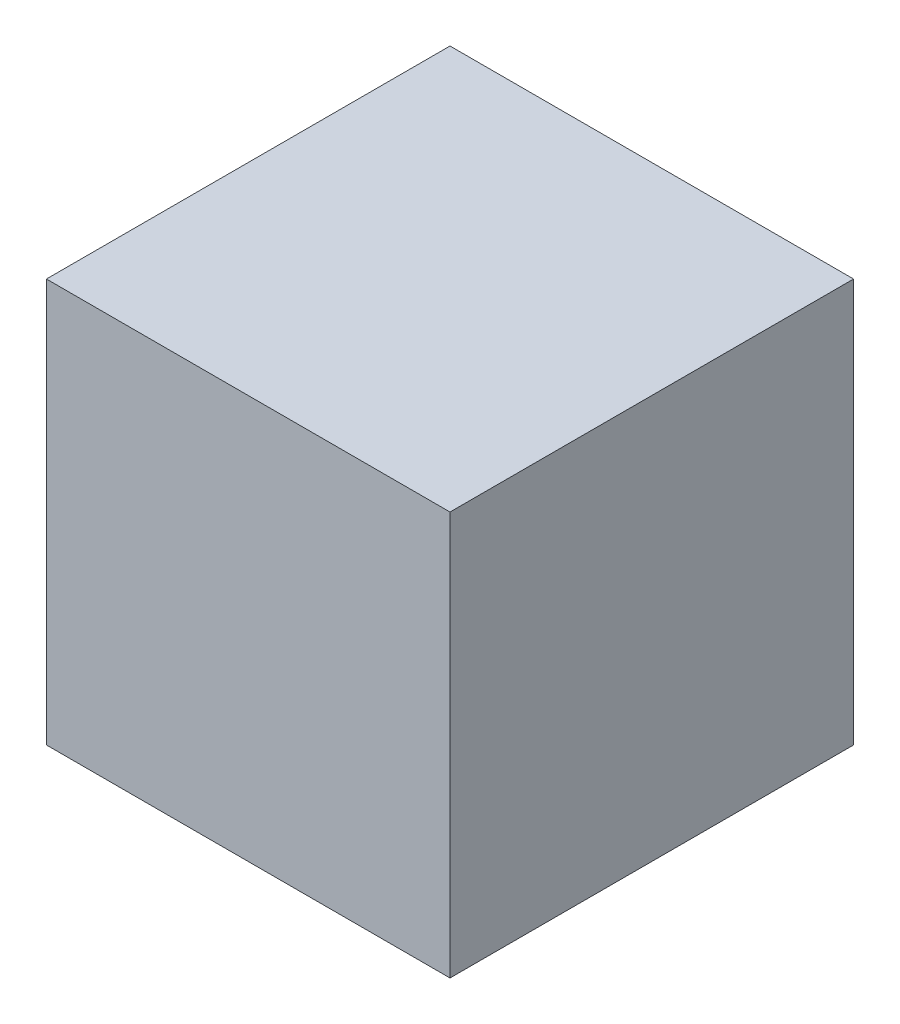
ISO-10303-21;
HEADER;
FILE_DESCRIPTION(('STEP AP214'),'2;1');
FILE_NAME('part.step','',(''),(''),'','','');
FILE_SCHEMA(('AUTOMOTIVE_DESIGN { 1 0 10303 214 1 1 1 1 }'));
ENDSEC;
DATA;
#1=APPLICATION_CONTEXT('core data for automotive mechanical design processes');
#2=APPLICATION_PROTOCOL_DEFINITION('international standard','automotive_design',2000,#1);
#3=PRODUCT_CONTEXT('',#1,'mechanical');
#4=PRODUCT('Part','Part','',(#3));
#5=PRODUCT_RELATED_PRODUCT_CATEGORY('part','',(#4));
#6=PRODUCT_DEFINITION_FORMATION('','',#4);
#7=PRODUCT_DEFINITION_CONTEXT('part definition',#1,'design');
#8=PRODUCT_DEFINITION('design','',#6,#7);
#9=PRODUCT_DEFINITION_SHAPE('','',#8);
#10=(LENGTH_UNIT() NAMED_UNIT(*) SI_UNIT(.MILLI.,.METRE.));
#11=(NAMED_UNIT(*) PLANE_ANGLE_UNIT() SI_UNIT($,.RADIAN.));
#12=(NAMED_UNIT(*) SI_UNIT($,.STERADIAN.) SOLID_ANGLE_UNIT());
#13=UNCERTAINTY_MEASURE_WITH_UNIT(LENGTH_MEASURE(1.E-05),#10,'distance_accuracy_value','');
#14=(GEOMETRIC_REPRESENTATION_CONTEXT(3) GLOBAL_UNCERTAINTY_ASSIGNED_CONTEXT((#13)) GLOBAL_UNIT_ASSIGNED_CONTEXT((#10,
#11,#12)) REPRESENTATION_CONTEXT('',''));
#15=CARTESIAN_POINT('',(0.,0.,0.));
#16=DIRECTION('',(0.,0.,1.));
#17=DIRECTION('',(1.,0.,0.));
#18=AXIS2_PLACEMENT_3D('',#15,#16,#17);
#19=CARTESIAN_POINT('',(0.,0.,60.));
#20=DIRECTION('',(1.,0.,0.));
#21=DIRECTION('',(0.,0.,-1.));
#22=AXIS2_PLACEMENT_3D('',#19,#20,#21);
#23=PLANE('',#22);
#24=DIRECTION('',(0.,-1.,0.));
#25=VECTOR('',#24,1.);
#26=CARTESIAN_POINT('',(0.,0.,0.));
#27=LINE('',#26,#25);
#28=CARTESIAN_POINT('',(0.,60.,0.));
#29=VERTEX_POINT('',#28);
#30=CARTESIAN_POINT('',(0.,0.,0.));
#31=VERTEX_POINT('',#30);
#32=EDGE_CURVE('E98',#29,#31,#27,.T.);
#33=ORIENTED_EDGE('',*,*,#32,.T.);
#34=DIRECTION('',(0.,0.,-1.));
#35=VECTOR('',#34,1.);
#36=CARTESIAN_POINT('',(0.,0.,60.));
#37=LINE('',#36,#35);
#38=CARTESIAN_POINT('',(0.,0.,60.));
#39=VERTEX_POINT('',#38);
#40=EDGE_CURVE('E11',#39,#31,#37,.T.);
#41=ORIENTED_EDGE('',*,*,#40,.F.);
#42=DIRECTION('',(0.,-1.,0.));
#43=VECTOR('',#42,1.);
#44=CARTESIAN_POINT('',(0.,0.,60.));
#45=LINE('',#44,#43);
#46=CARTESIAN_POINT('',(0.,60.,60.));
#47=VERTEX_POINT('',#46);
#48=EDGE_CURVE('E86',#47,#39,#45,.T.);
#49=ORIENTED_EDGE('',*,*,#48,.F.);
#50=DIRECTION('',(0.,0.,-1.));
#51=VECTOR('',#50,1.);
#52=CARTESIAN_POINT('',(0.,60.,60.));
#53=LINE('',#52,#51);
#54=EDGE_CURVE('E94',#47,#29,#53,.T.);
#55=ORIENTED_EDGE('',*,*,#54,.T.);
#56=EDGE_LOOP('',(#33,#41,#49,#55));
#57=FACE_BOUND('',#56,.T.);
#58=ADVANCED_FACE('F35',(#57),#23,.F.);
#59=CARTESIAN_POINT('',(0.,0.,60.));
#60=DIRECTION('',(0.,1.,0.));
#61=DIRECTION('',(0.,0.,1.));
#62=AXIS2_PLACEMENT_3D('',#59,#60,#61);
#63=PLANE('',#62);
#64=DIRECTION('',(1.,0.,0.));
#65=VECTOR('',#64,1.);
#66=CARTESIAN_POINT('',(0.,0.,0.));
#67=LINE('',#66,#65);
#68=CARTESIAN_POINT('',(60.,0.,0.));
#69=VERTEX_POINT('',#68);
#70=EDGE_CURVE('E90',#31,#69,#67,.T.);
#71=ORIENTED_EDGE('',*,*,#70,.T.);
#72=DIRECTION('',(0.,0.,-1.));
#73=VECTOR('',#72,1.);
#74=CARTESIAN_POINT('',(60.,0.,60.));
#75=LINE('',#74,#73);
#76=CARTESIAN_POINT('',(60.,0.,60.));
#77=VERTEX_POINT('',#76);
#78=EDGE_CURVE('E43',#77,#69,#75,.T.);
#79=ORIENTED_EDGE('',*,*,#78,.F.);
#80=DIRECTION('',(1.,0.,0.));
#81=VECTOR('',#80,1.);
#82=CARTESIAN_POINT('',(0.,0.,60.));
#83=LINE('',#82,#81);
#84=EDGE_CURVE('E81',#39,#77,#83,.T.);
#85=ORIENTED_EDGE('',*,*,#84,.F.);
#86=ORIENTED_EDGE('',*,*,#40,.T.);
#87=EDGE_LOOP('',(#71,#79,#85,#86));
#88=FACE_BOUND('',#87,.T.);
#89=ADVANCED_FACE('F89',(#88),#63,.F.);
#90=CARTESIAN_POINT('',(60.,0.,60.));
#91=DIRECTION('',(-1.,0.,0.));
#92=DIRECTION('',(0.,0.,1.));
#93=AXIS2_PLACEMENT_3D('',#90,#91,#92);
#94=PLANE('',#93);
#95=DIRECTION('',(0.,1.,0.));
#96=VECTOR('',#95,1.);
#97=CARTESIAN_POINT('',(60.,0.,0.));
#98=LINE('',#97,#96);
#99=CARTESIAN_POINT('',(60.,60.,0.));
#100=VERTEX_POINT('',#99);
#101=EDGE_CURVE('E68',#69,#100,#98,.T.);
#102=ORIENTED_EDGE('',*,*,#101,.T.);
#103=DIRECTION('',(0.,0.,-1.));
#104=VECTOR('',#103,1.);
#105=CARTESIAN_POINT('',(60.,60.,60.));
#106=LINE('',#105,#104);
#107=CARTESIAN_POINT('',(60.,60.,60.));
#108=VERTEX_POINT('',#107);
#109=EDGE_CURVE('E91',#108,#100,#106,.T.);
#110=ORIENTED_EDGE('',*,*,#109,.F.);
#111=DIRECTION('',(0.,1.,0.));
#112=VECTOR('',#111,1.);
#113=CARTESIAN_POINT('',(60.,0.,60.));
#114=LINE('',#113,#112);
#115=EDGE_CURVE('E84',#77,#108,#114,.T.);
#116=ORIENTED_EDGE('',*,*,#115,.F.);
#117=ORIENTED_EDGE('',*,*,#78,.T.);
#118=EDGE_LOOP('',(#102,#110,#116,#117));
#119=FACE_BOUND('',#118,.T.);
#120=ADVANCED_FACE('F92',(#119),#94,.F.);
#121=CARTESIAN_POINT('',(0.,60.,60.));
#122=DIRECTION('',(0.,-1.,0.));
#123=DIRECTION('',(0.,0.,-1.));
#124=AXIS2_PLACEMENT_3D('',#121,#122,#123);
#125=PLANE('',#124);
#126=DIRECTION('',(-1.,0.,0.));
#127=VECTOR('',#126,1.);
#128=CARTESIAN_POINT('',(0.,60.,0.));
#129=LINE('',#128,#127);
#130=EDGE_CURVE('E74',#100,#29,#129,.T.);
#131=ORIENTED_EDGE('',*,*,#130,.T.);
#132=ORIENTED_EDGE('',*,*,#54,.F.);
#133=DIRECTION('',(-1.,0.,0.));
#134=VECTOR('',#133,1.);
#135=CARTESIAN_POINT('',(0.,60.,60.));
#136=LINE('',#135,#134);
#137=EDGE_CURVE('E51',#108,#47,#136,.T.);
#138=ORIENTED_EDGE('',*,*,#137,.F.);
#139=ORIENTED_EDGE('',*,*,#109,.T.);
#140=EDGE_LOOP('',(#131,#132,#138,#139));
#141=FACE_BOUND('',#140,.T.);
#142=ADVANCED_FACE('F105',(#141),#125,.F.);
#143=CARTESIAN_POINT('',(0.,0.,60.));
#144=DIRECTION('',(0.,0.,-1.));
#145=DIRECTION('',(-1.,0.,0.));
#146=AXIS2_PLACEMENT_3D('',#143,#144,#145);
#147=PLANE('',#146);
#148=ORIENTED_EDGE('',*,*,#48,.T.);
#149=ORIENTED_EDGE('',*,*,#84,.T.);
#150=ORIENTED_EDGE('',*,*,#115,.T.);
#151=ORIENTED_EDGE('',*,*,#137,.T.);
#152=EDGE_LOOP('',(#148,#149,#150,#151));
#153=FACE_BOUND('',#152,.T.);
#154=ADVANCED_FACE('F82',(#153),#147,.F.);
#155=CARTESIAN_POINT('',(0.,0.,0.));
#156=DIRECTION('',(0.,0.,-1.));
#157=DIRECTION('',(-1.,0.,0.));
#158=AXIS2_PLACEMENT_3D('',#155,#156,#157);
#159=PLANE('',#158);
#160=ORIENTED_EDGE('',*,*,#32,.F.);
#161=ORIENTED_EDGE('',*,*,#130,.F.);
#162=ORIENTED_EDGE('',*,*,#101,.F.);
#163=ORIENTED_EDGE('',*,*,#70,.F.);
#164=EDGE_LOOP('',(#160,#161,#162,#163));
#165=FACE_BOUND('',#164,.T.);
#166=ADVANCED_FACE('F108',(#165),#159,.T.);
#167=CLOSED_SHELL('',(#58,#89,#120,#142,#154,#166));
#168=MANIFOLD_SOLID_BREP('B2',#167);
#169=ADVANCED_BREP_SHAPE_REPRESENTATION('',(#18,#168),#14);
#170=SHAPE_DEFINITION_REPRESENTATION(#9,#169);
ENDSEC;
END-ISO-10303-21;
